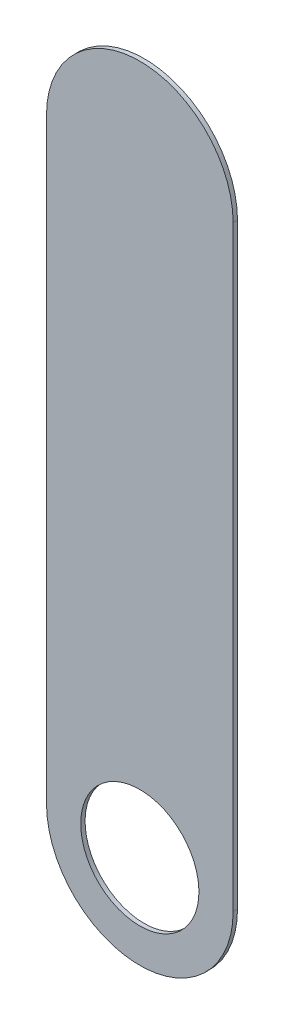
ISO-10303-21;
HEADER;
FILE_DESCRIPTION(('STEP AP214'),'2;1');
FILE_NAME('part.step','',(''),(''),'','','');
FILE_SCHEMA(('AUTOMOTIVE_DESIGN { 1 0 10303 214 1 1 1 1 }'));
ENDSEC;
DATA;
#1=APPLICATION_CONTEXT('core data for automotive mechanical design processes');
#2=APPLICATION_PROTOCOL_DEFINITION('international standard','automotive_design',2000,#1);
#3=PRODUCT_CONTEXT('',#1,'mechanical');
#4=PRODUCT('Part','Part','',(#3));
#5=PRODUCT_RELATED_PRODUCT_CATEGORY('part','',(#4));
#6=PRODUCT_DEFINITION_FORMATION('','',#4);
#7=PRODUCT_DEFINITION_CONTEXT('part definition',#1,'design');
#8=PRODUCT_DEFINITION('design','',#6,#7);
#9=PRODUCT_DEFINITION_SHAPE('','',#8);
#10=(LENGTH_UNIT() NAMED_UNIT(*) SI_UNIT(.MILLI.,.METRE.));
#11=(NAMED_UNIT(*) PLANE_ANGLE_UNIT() SI_UNIT($,.RADIAN.));
#12=(NAMED_UNIT(*) SI_UNIT($,.STERADIAN.) SOLID_ANGLE_UNIT());
#13=UNCERTAINTY_MEASURE_WITH_UNIT(LENGTH_MEASURE(1.E-05),#10,'distance_accuracy_value','');
#14=(GEOMETRIC_REPRESENTATION_CONTEXT(3) GLOBAL_UNCERTAINTY_ASSIGNED_CONTEXT((#13)) GLOBAL_UNIT_ASSIGNED_CONTEXT((#10,
#11,#12)) REPRESENTATION_CONTEXT('',''));
#15=CARTESIAN_POINT('',(0.,0.,0.));
#16=DIRECTION('',(0.,0.,1.));
#17=DIRECTION('',(1.,0.,0.));
#18=AXIS2_PLACEMENT_3D('',#15,#16,#17);
#19=CARTESIAN_POINT('',(113.792,-122.169,-0.045));
#20=DIRECTION('',(0.,0.,-1.));
#21=DIRECTION('',(0.,-1.,0.));
#22=AXIS2_PLACEMENT_3D('',#19,#20,#21);
#23=CYLINDRICAL_SURFACE('',#22,0.475);
#24=CARTESIAN_POINT('',(113.792,-122.169,-0.035));
#25=DIRECTION('',(0.,0.,-1.));
#26=DIRECTION('',(0.,-1.,0.));
#27=AXIS2_PLACEMENT_3D('',#24,#25,#26);
#28=CIRCLE('',#27,0.475);
#29=CARTESIAN_POINT('',(113.792,-122.644,-0.035));
#30=VERTEX_POINT('',#29);
#31=EDGE_CURVE('E131',#30,#30,#28,.T.);
#32=ORIENTED_EDGE('',*,*,#31,.T.);
#33=DIRECTION('',(0.,0.,1.));
#34=VECTOR('',#33,1.);
#35=CARTESIAN_POINT('',(113.792,-122.644,-0.045));
#36=LINE('',#35,#34);
#37=CARTESIAN_POINT('',(113.792,-122.644,0.));
#38=VERTEX_POINT('',#37);
#39=EDGE_CURVE('E11',#30,#38,#36,.T.);
#40=ORIENTED_EDGE('',*,*,#39,.T.);
#41=CARTESIAN_POINT('',(113.792,-122.169,0.));
#42=DIRECTION('',(0.,0.,-1.));
#43=DIRECTION('',(0.,-1.,0.));
#44=AXIS2_PLACEMENT_3D('',#41,#42,#43);
#45=CIRCLE('',#44,0.475);
#46=EDGE_CURVE('E26',#38,#38,#45,.T.);
#47=ORIENTED_EDGE('',*,*,#46,.F.);
#48=ORIENTED_EDGE('',*,*,#39,.F.);
#49=EDGE_LOOP('',(#32,#40,#47,#48));
#50=FACE_BOUND('',#49,.T.);
#51=ADVANCED_FACE('F17',(#50),#23,.F.);
#52=CARTESIAN_POINT('',(113.042,-117.374,-0.035));
#53=DIRECTION('',(1.,0.,0.));
#54=DIRECTION('',(0.,1.,0.));
#55=AXIS2_PLACEMENT_3D('',#52,#53,#54);
#56=PLANE('',#55);
#57=DIRECTION('',(0.,-1.,0.));
#58=VECTOR('',#57,1.);
#59=CARTESIAN_POINT('',(113.042,-117.374,-0.035));
#60=LINE('',#59,#58);
#61=CARTESIAN_POINT('',(113.042,-117.374,-0.035));
#62=VERTEX_POINT('',#61);
#63=CARTESIAN_POINT('',(113.042,-122.169,-0.035));
#64=VERTEX_POINT('',#63);
#65=EDGE_CURVE('E129',#62,#64,#60,.T.);
#66=ORIENTED_EDGE('',*,*,#65,.T.);
#67=DIRECTION('',(0.,0.,1.));
#68=VECTOR('',#67,1.);
#69=CARTESIAN_POINT('',(113.042,-122.169,-0.035));
#70=LINE('',#69,#68);
#71=CARTESIAN_POINT('',(113.042,-122.169,0.));
#72=VERTEX_POINT('',#71);
#73=EDGE_CURVE('E85',#64,#72,#70,.T.);
#74=ORIENTED_EDGE('',*,*,#73,.T.);
#75=DIRECTION('',(0.,-1.,0.));
#76=VECTOR('',#75,1.);
#77=CARTESIAN_POINT('',(113.042,-117.374,0.));
#78=LINE('',#77,#76);
#79=CARTESIAN_POINT('',(113.042,-117.374,0.));
#80=VERTEX_POINT('',#79);
#81=EDGE_CURVE('E20',#80,#72,#78,.T.);
#82=ORIENTED_EDGE('',*,*,#81,.F.);
#83=DIRECTION('',(0.,0.,1.));
#84=VECTOR('',#83,1.);
#85=CARTESIAN_POINT('',(113.042,-117.374,-0.035));
#86=LINE('',#85,#84);
#87=EDGE_CURVE('E125',#62,#80,#86,.T.);
#88=ORIENTED_EDGE('',*,*,#87,.F.);
#89=EDGE_LOOP('',(#66,#74,#82,#88));
#90=FACE_BOUND('',#89,.T.);
#91=ADVANCED_FACE('F144',(#90),#56,.F.);
#92=CARTESIAN_POINT('',(114.542,-122.169,0.));
#93=DIRECTION('',(0.,0.,1.));
#94=DIRECTION('',(1.,0.,0.));
#95=AXIS2_PLACEMENT_3D('',#92,#93,#94);
#96=PLANE('',#95);
#97=ORIENTED_EDGE('',*,*,#46,.T.);
#98=EDGE_LOOP('',(#97));
#99=FACE_BOUND('',#98,.T.);
#100=DIRECTION('',(0.,1.,0.));
#101=VECTOR('',#100,1.);
#102=CARTESIAN_POINT('',(114.542,-122.169,0.));
#103=LINE('',#102,#101);
#104=CARTESIAN_POINT('',(114.542,-122.169,0.));
#105=VERTEX_POINT('',#104);
#106=CARTESIAN_POINT('',(114.542,-117.374,0.));
#107=VERTEX_POINT('',#106);
#108=EDGE_CURVE('E97',#105,#107,#103,.T.);
#109=ORIENTED_EDGE('',*,*,#108,.T.);
#110=CARTESIAN_POINT('',(113.792,-117.374,0.));
#111=DIRECTION('',(0.,0.,1.));
#112=DIRECTION('',(1.,0.,0.));
#113=AXIS2_PLACEMENT_3D('',#110,#111,#112);
#114=CIRCLE('',#113,0.75);
#115=EDGE_CURVE('E113',#107,#80,#114,.T.);
#116=ORIENTED_EDGE('',*,*,#115,.T.);
#117=ORIENTED_EDGE('',*,*,#81,.T.);
#118=CARTESIAN_POINT('',(113.792,-122.169,0.));
#119=DIRECTION('',(0.,0.,1.));
#120=DIRECTION('',(-1.,0.,0.));
#121=AXIS2_PLACEMENT_3D('',#118,#119,#120);
#122=CIRCLE('',#121,0.75);
#123=EDGE_CURVE('E89',#72,#105,#122,.T.);
#124=ORIENTED_EDGE('',*,*,#123,.T.);
#125=EDGE_LOOP('',(#109,#116,#117,#124));
#126=FACE_BOUND('',#125,.T.);
#127=ADVANCED_FACE('F141',(#99,#126),#96,.T.);
#128=CARTESIAN_POINT('',(114.542,-122.169,-0.035));
#129=DIRECTION('',(0.,0.,1.));
#130=DIRECTION('',(1.,0.,0.));
#131=AXIS2_PLACEMENT_3D('',#128,#129,#130);
#132=PLANE('',#131);
#133=ORIENTED_EDGE('',*,*,#31,.F.);
#134=EDGE_LOOP('',(#133));
#135=FACE_BOUND('',#134,.T.);
#136=CARTESIAN_POINT('',(113.792,-122.169,-0.035));
#137=DIRECTION('',(0.,0.,1.));
#138=DIRECTION('',(-1.,0.,0.));
#139=AXIS2_PLACEMENT_3D('',#136,#137,#138);
#140=CIRCLE('',#139,0.75);
#141=CARTESIAN_POINT('',(114.542,-122.169,-0.035));
#142=VERTEX_POINT('',#141);
#143=EDGE_CURVE('E78',#64,#142,#140,.T.);
#144=ORIENTED_EDGE('',*,*,#143,.F.);
#145=ORIENTED_EDGE('',*,*,#65,.F.);
#146=CARTESIAN_POINT('',(113.792,-117.374,-0.035));
#147=DIRECTION('',(0.,0.,1.));
#148=DIRECTION('',(1.,0.,0.));
#149=AXIS2_PLACEMENT_3D('',#146,#147,#148);
#150=CIRCLE('',#149,0.75);
#151=CARTESIAN_POINT('',(114.542,-117.374,-0.035));
#152=VERTEX_POINT('',#151);
#153=EDGE_CURVE('E102',#152,#62,#150,.T.);
#154=ORIENTED_EDGE('',*,*,#153,.F.);
#155=DIRECTION('',(0.,1.,0.));
#156=VECTOR('',#155,1.);
#157=CARTESIAN_POINT('',(114.542,-122.169,-0.035));
#158=LINE('',#157,#156);
#159=EDGE_CURVE('E95',#142,#152,#158,.T.);
#160=ORIENTED_EDGE('',*,*,#159,.F.);
#161=EDGE_LOOP('',(#144,#145,#154,#160));
#162=FACE_BOUND('',#161,.T.);
#163=ADVANCED_FACE('F100',(#135,#162),#132,.F.);
#164=CARTESIAN_POINT('',(113.792,-117.374,-0.035));
#165=DIRECTION('',(0.,0.,-1.));
#166=DIRECTION('',(1.,0.,0.));
#167=AXIS2_PLACEMENT_3D('',#164,#165,#166);
#168=CYLINDRICAL_SURFACE('',#167,0.75);
#169=ORIENTED_EDGE('',*,*,#153,.T.);
#170=ORIENTED_EDGE('',*,*,#87,.T.);
#171=ORIENTED_EDGE('',*,*,#115,.F.);
#172=DIRECTION('',(0.,0.,1.));
#173=VECTOR('',#172,1.);
#174=CARTESIAN_POINT('',(114.542,-117.374,-0.035));
#175=LINE('',#174,#173);
#176=EDGE_CURVE('E105',#152,#107,#175,.T.);
#177=ORIENTED_EDGE('',*,*,#176,.F.);
#178=EDGE_LOOP('',(#169,#170,#171,#177));
#179=FACE_BOUND('',#178,.T.);
#180=ADVANCED_FACE('F146',(#179),#168,.T.);
#181=CARTESIAN_POINT('',(113.792,-122.169,-0.035));
#182=DIRECTION('',(0.,0.,-1.));
#183=DIRECTION('',(-1.,0.,0.));
#184=AXIS2_PLACEMENT_3D('',#181,#182,#183);
#185=CYLINDRICAL_SURFACE('',#184,0.75);
#186=ORIENTED_EDGE('',*,*,#143,.T.);
#187=DIRECTION('',(0.,0.,1.));
#188=VECTOR('',#187,1.);
#189=CARTESIAN_POINT('',(114.542,-122.169,-0.035));
#190=LINE('',#189,#188);
#191=EDGE_CURVE('E82',#142,#105,#190,.T.);
#192=ORIENTED_EDGE('',*,*,#191,.T.);
#193=ORIENTED_EDGE('',*,*,#123,.F.);
#194=ORIENTED_EDGE('',*,*,#73,.F.);
#195=EDGE_LOOP('',(#186,#192,#193,#194));
#196=FACE_BOUND('',#195,.T.);
#197=ADVANCED_FACE('F80',(#196),#185,.T.);
#198=CARTESIAN_POINT('',(114.542,-122.169,-0.035));
#199=DIRECTION('',(-1.,0.,0.));
#200=DIRECTION('',(0.,0.,1.));
#201=AXIS2_PLACEMENT_3D('',#198,#199,#200);
#202=PLANE('',#201);
#203=ORIENTED_EDGE('',*,*,#159,.T.);
#204=ORIENTED_EDGE('',*,*,#176,.T.);
#205=ORIENTED_EDGE('',*,*,#108,.F.);
#206=ORIENTED_EDGE('',*,*,#191,.F.);
#207=EDGE_LOOP('',(#203,#204,#205,#206));
#208=FACE_BOUND('',#207,.T.);
#209=ADVANCED_FACE('F93',(#208),#202,.F.);
#210=CLOSED_SHELL('',(#51,#91,#127,#163,#180,#197,#209));
#211=MANIFOLD_SOLID_BREP('B1',#210);
#212=ADVANCED_BREP_SHAPE_REPRESENTATION('',(#18,#211),#14);
#213=SHAPE_DEFINITION_REPRESENTATION(#9,#212);
ENDSEC;
END-ISO-10303-21;
